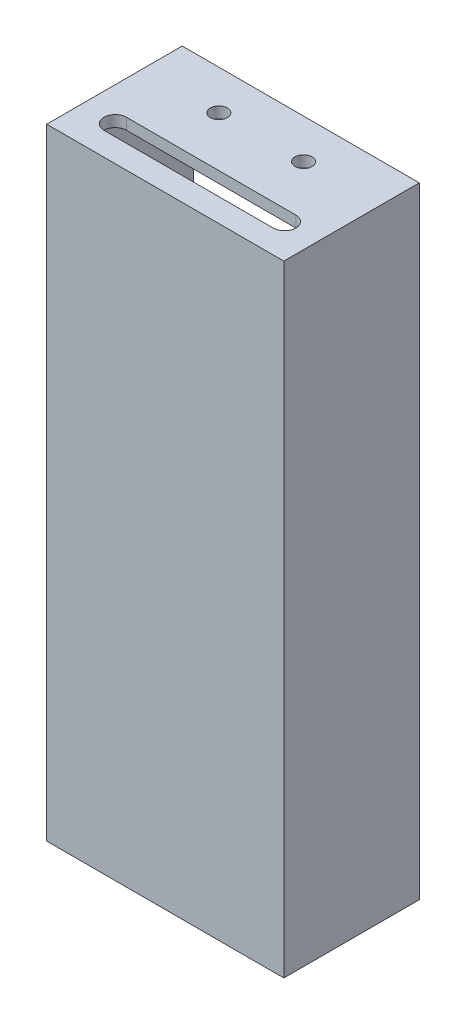
ISO-10303-21;
HEADER;
FILE_DESCRIPTION(('STEP AP214'),'2;1');
FILE_NAME('part.step','',(''),(''),'','','');
FILE_SCHEMA(('AUTOMOTIVE_DESIGN { 1 0 10303 214 1 1 1 1 }'));
ENDSEC;
DATA;
#1=APPLICATION_CONTEXT('core data for automotive mechanical design processes');
#2=APPLICATION_PROTOCOL_DEFINITION('international standard','automotive_design',2000,#1);
#3=PRODUCT_CONTEXT('',#1,'mechanical');
#4=PRODUCT('Part','Part','',(#3));
#5=PRODUCT_RELATED_PRODUCT_CATEGORY('part','',(#4));
#6=PRODUCT_DEFINITION_FORMATION('','',#4);
#7=PRODUCT_DEFINITION_CONTEXT('part definition',#1,'design');
#8=PRODUCT_DEFINITION('design','',#6,#7);
#9=PRODUCT_DEFINITION_SHAPE('','',#8);
#10=(LENGTH_UNIT() NAMED_UNIT(*) SI_UNIT(.MILLI.,.METRE.));
#11=(NAMED_UNIT(*) PLANE_ANGLE_UNIT() SI_UNIT($,.RADIAN.));
#12=(NAMED_UNIT(*) SI_UNIT($,.STERADIAN.) SOLID_ANGLE_UNIT());
#13=UNCERTAINTY_MEASURE_WITH_UNIT(LENGTH_MEASURE(1.E-05),#10,'distance_accuracy_value','');
#14=(GEOMETRIC_REPRESENTATION_CONTEXT(3) GLOBAL_UNCERTAINTY_ASSIGNED_CONTEXT((#13)) GLOBAL_UNIT_ASSIGNED_CONTEXT((#10,
#11,#12)) REPRESENTATION_CONTEXT('',''));
#15=CARTESIAN_POINT('',(0.,0.,0.));
#16=DIRECTION('',(0.,0.,1.));
#17=DIRECTION('',(1.,0.,0.));
#18=AXIS2_PLACEMENT_3D('',#15,#16,#17);
#19=CARTESIAN_POINT('',(0.,32.6753246753247,-22.));
#20=DIRECTION('',(1.,0.,0.));
#21=DIRECTION('',(0.,1.,0.));
#22=AXIS2_PLACEMENT_3D('',#19,#20,#21);
#23=PLANE('',#22);
#24=DIRECTION('',(0.,-1.,0.));
#25=VECTOR('',#24,1.);
#26=CARTESIAN_POINT('',(0.,32.6753246753247,-20.));
#27=LINE('',#26,#25);
#28=CARTESIAN_POINT('',(0.,32.6753246753247,-20.));
#29=VERTEX_POINT('',#28);
#30=CARTESIAN_POINT('',(0.,-34.3246753246753,-20.));
#31=VERTEX_POINT('',#30);
#32=EDGE_CURVE('E215',#29,#31,#27,.T.);
#33=ORIENTED_EDGE('',*,*,#32,.T.);
#34=DIRECTION('',(0.,0.,1.));
#35=VECTOR('',#34,1.);
#36=CARTESIAN_POINT('',(0.,-34.3246753246753,0.));
#37=LINE('',#36,#35);
#38=CARTESIAN_POINT('',(0.,-34.3246753246753,0.));
#39=VERTEX_POINT('',#38);
#40=EDGE_CURVE('E228',#31,#39,#37,.T.);
#41=ORIENTED_EDGE('',*,*,#40,.T.);
#42=DIRECTION('',(0.,1.,0.));
#43=VECTOR('',#42,1.);
#44=CARTESIAN_POINT('',(0.,73.6753246753247,0.));
#45=LINE('',#44,#43);
#46=CARTESIAN_POINT('',(0.,32.6753246753247,0.));
#47=VERTEX_POINT('',#46);
#48=EDGE_CURVE('E474',#39,#47,#45,.T.);
#49=ORIENTED_EDGE('',*,*,#48,.T.);
#50=DIRECTION('',(0.,0.,1.));
#51=VECTOR('',#50,1.);
#52=CARTESIAN_POINT('',(0.,32.6753246753247,-22.));
#53=LINE('',#52,#51);
#54=EDGE_CURVE('E387',#29,#47,#53,.T.);
#55=ORIENTED_EDGE('',*,*,#54,.F.);
#56=EDGE_LOOP('',(#33,#41,#49,#55));
#57=FACE_BOUND('',#56,.T.);
#58=ADVANCED_FACE('F45',(#57),#23,.F.);
#59=CARTESIAN_POINT('',(-38.,32.6753246753247,-22.));
#60=DIRECTION('',(-1.,0.,0.));
#61=DIRECTION('',(0.,0.,1.));
#62=AXIS2_PLACEMENT_3D('',#59,#60,#61);
#63=PLANE('',#62);
#64=DIRECTION('',(0.,0.,1.));
#65=VECTOR('',#64,1.);
#66=CARTESIAN_POINT('',(-38.,22.6753246753247,-22.));
#67=LINE('',#66,#65);
#68=CARTESIAN_POINT('',(-38.,22.6753246753247,-10.));
#69=VERTEX_POINT('',#68);
#70=CARTESIAN_POINT('',(-38.,22.6753246753247,-4.));
#71=VERTEX_POINT('',#70);
#72=EDGE_CURVE('E379',#69,#71,#67,.T.);
#73=ORIENTED_EDGE('',*,*,#72,.T.);
#74=DIRECTION('',(0.,1.,0.));
#75=VECTOR('',#74,1.);
#76=CARTESIAN_POINT('',(-38.,32.6753246753247,-4.));
#77=LINE('',#76,#75);
#78=CARTESIAN_POINT('',(-38.,30.6753246753247,-4.));
#79=VERTEX_POINT('',#78);
#80=EDGE_CURVE('E383',#71,#79,#77,.T.);
#81=ORIENTED_EDGE('',*,*,#80,.T.);
#82=DIRECTION('',(0.,0.,-1.));
#83=VECTOR('',#82,1.);
#84=CARTESIAN_POINT('',(-38.,30.6753246753247,-22.));
#85=LINE('',#84,#83);
#86=CARTESIAN_POINT('',(-38.,30.6753246753247,-10.));
#87=VERTEX_POINT('',#86);
#88=EDGE_CURVE('E371',#79,#87,#85,.T.);
#89=ORIENTED_EDGE('',*,*,#88,.T.);
#90=DIRECTION('',(0.,-1.,0.));
#91=VECTOR('',#90,1.);
#92=CARTESIAN_POINT('',(-38.,32.6753246753247,-10.));
#93=LINE('',#92,#91);
#94=EDGE_CURVE('E375',#87,#69,#93,.T.);
#95=ORIENTED_EDGE('',*,*,#94,.T.);
#96=EDGE_LOOP('',(#73,#81,#89,#95));
#97=FACE_BOUND('',#96,.T.);
#98=DIRECTION('',(0.,1.,0.));
#99=VECTOR('',#98,1.);
#100=CARTESIAN_POINT('',(-38.,32.6753246753247,-20.));
#101=LINE('',#100,#99);
#102=CARTESIAN_POINT('',(-38.,-34.3246753246753,-20.));
#103=VERTEX_POINT('',#102);
#104=CARTESIAN_POINT('',(-38.,32.6753246753247,-20.));
#105=VERTEX_POINT('',#104);
#106=EDGE_CURVE('E208',#103,#105,#101,.T.);
#107=ORIENTED_EDGE('',*,*,#106,.T.);
#108=DIRECTION('',(0.,0.,1.));
#109=VECTOR('',#108,1.);
#110=CARTESIAN_POINT('',(-38.,32.6753246753247,-22.));
#111=LINE('',#110,#109);
#112=CARTESIAN_POINT('',(-38.,32.6753246753247,0.));
#113=VERTEX_POINT('',#112);
#114=EDGE_CURVE('E388',#105,#113,#111,.T.);
#115=ORIENTED_EDGE('',*,*,#114,.T.);
#116=DIRECTION('',(0.,-1.,0.));
#117=VECTOR('',#116,1.);
#118=CARTESIAN_POINT('',(-38.,73.6753246753247,0.));
#119=LINE('',#118,#117);
#120=CARTESIAN_POINT('',(-38.,-34.3246753246753,0.));
#121=VERTEX_POINT('',#120);
#122=EDGE_CURVE('E61',#113,#121,#119,.T.);
#123=ORIENTED_EDGE('',*,*,#122,.T.);
#124=DIRECTION('',(0.,0.,-1.));
#125=VECTOR('',#124,1.);
#126=CARTESIAN_POINT('',(-38.,-34.3246753246753,0.));
#127=LINE('',#126,#125);
#128=EDGE_CURVE('E218',#121,#103,#127,.T.);
#129=ORIENTED_EDGE('',*,*,#128,.T.);
#130=EDGE_LOOP('',(#107,#115,#123,#129));
#131=FACE_BOUND('',#130,.T.);
#132=ADVANCED_FACE('F219',(#97,#131),#63,.F.);
#133=CARTESIAN_POINT('',(-38.,32.6753246753247,-22.));
#134=DIRECTION('',(0.,1.,0.));
#135=DIRECTION('',(0.,0.,1.));
#136=AXIS2_PLACEMENT_3D('',#133,#134,#135);
#137=PLANE('',#136);
#138=DIRECTION('',(1.,0.,0.));
#139=VECTOR('',#138,1.);
#140=CARTESIAN_POINT('',(0.,32.6753246753247,-20.));
#141=LINE('',#140,#139);
#142=EDGE_CURVE('E69',#105,#29,#141,.T.);
#143=ORIENTED_EDGE('',*,*,#142,.T.);
#144=ORIENTED_EDGE('',*,*,#54,.T.);
#145=DIRECTION('',(-1.,0.,0.));
#146=VECTOR('',#145,1.);
#147=CARTESIAN_POINT('',(0.,32.6753246753247,0.));
#148=LINE('',#147,#146);
#149=EDGE_CURVE('E54',#47,#113,#148,.T.);
#150=ORIENTED_EDGE('',*,*,#149,.T.);
#151=ORIENTED_EDGE('',*,*,#114,.F.);
#152=EDGE_LOOP('',(#143,#144,#150,#151));
#153=FACE_BOUND('',#152,.T.);
#154=ADVANCED_FACE('F484',(#153),#137,.F.);
#155=CARTESIAN_POINT('',(-38.,73.6753246753247,-22.));
#156=DIRECTION('',(-1.,0.,0.));
#157=DIRECTION('',(0.,-1.,0.));
#158=AXIS2_PLACEMENT_3D('',#155,#156,#157);
#159=PLANE('',#158);
#160=DIRECTION('',(0.,0.,-1.));
#161=VECTOR('',#160,1.);
#162=CARTESIAN_POINT('',(-38.,57.6753246753246,-22.));
#163=LINE('',#162,#161);
#164=CARTESIAN_POINT('',(-38.,57.6753246753247,-4.));
#165=VERTEX_POINT('',#164);
#166=CARTESIAN_POINT('',(-38.,57.6753246753247,-10.));
#167=VERTEX_POINT('',#166);
#168=EDGE_CURVE('E363',#165,#167,#163,.T.);
#169=ORIENTED_EDGE('',*,*,#168,.T.);
#170=DIRECTION('',(0.,-1.,0.));
#171=VECTOR('',#170,1.);
#172=CARTESIAN_POINT('',(-38.,73.6753246753247,-10.));
#173=LINE('',#172,#171);
#174=CARTESIAN_POINT('',(-38.,49.6753246753247,-10.));
#175=VERTEX_POINT('',#174);
#176=EDGE_CURVE('E367',#167,#175,#173,.T.);
#177=ORIENTED_EDGE('',*,*,#176,.T.);
#178=DIRECTION('',(0.,0.,1.));
#179=VECTOR('',#178,1.);
#180=CARTESIAN_POINT('',(-38.,49.6753246753247,-22.));
#181=LINE('',#180,#179);
#182=CARTESIAN_POINT('',(-38.,49.6753246753247,-4.));
#183=VERTEX_POINT('',#182);
#184=EDGE_CURVE('E320',#175,#183,#181,.T.);
#185=ORIENTED_EDGE('',*,*,#184,.T.);
#186=DIRECTION('',(0.,1.,0.));
#187=VECTOR('',#186,1.);
#188=CARTESIAN_POINT('',(-38.,73.6753246753247,-4.));
#189=LINE('',#188,#187);
#190=EDGE_CURVE('E359',#183,#165,#189,.T.);
#191=ORIENTED_EDGE('',*,*,#190,.T.);
#192=EDGE_LOOP('',(#169,#177,#185,#191));
#193=FACE_BOUND('',#192,.T.);
#194=DIRECTION('',(0.,0.,1.));
#195=VECTOR('',#194,1.);
#196=CARTESIAN_POINT('',(-38.,73.6753246753247,-22.));
#197=LINE('',#196,#195);
#198=CARTESIAN_POINT('',(-38.,73.6753246753247,-22.));
#199=VERTEX_POINT('',#198);
#200=CARTESIAN_POINT('',(-38.,73.6753246753247,0.));
#201=VERTEX_POINT('',#200);
#202=EDGE_CURVE('E410',#199,#201,#197,.T.);
#203=ORIENTED_EDGE('',*,*,#202,.T.);
#204=CARTESIAN_POINT('',(-38.,34.6753246753247,0.));
#205=VERTEX_POINT('',#204);
#206=EDGE_CURVE('E469',#201,#205,#119,.T.);
#207=ORIENTED_EDGE('',*,*,#206,.T.);
#208=DIRECTION('',(0.,0.,1.));
#209=VECTOR('',#208,1.);
#210=CARTESIAN_POINT('',(-38.,34.6753246753247,-22.));
#211=LINE('',#210,#209);
#212=CARTESIAN_POINT('',(-38.,34.6753246753247,-22.));
#213=VERTEX_POINT('',#212);
#214=EDGE_CURVE('E409',#213,#205,#211,.T.);
#215=ORIENTED_EDGE('',*,*,#214,.F.);
#216=DIRECTION('',(0.,-1.,0.));
#217=VECTOR('',#216,1.);
#218=CARTESIAN_POINT('',(-38.,73.6753246753247,-22.));
#219=LINE('',#218,#217);
#220=EDGE_CURVE('E391',#199,#213,#219,.T.);
#221=ORIENTED_EDGE('',*,*,#220,.F.);
#222=EDGE_LOOP('',(#203,#207,#215,#221));
#223=FACE_BOUND('',#222,.T.);
#224=ADVANCED_FACE('F503',(#193,#223),#159,.F.);
#225=CARTESIAN_POINT('',(-38.,73.6753246753247,-22.));
#226=DIRECTION('',(0.,1.,0.));
#227=DIRECTION('',(0.,0.,1.));
#228=AXIS2_PLACEMENT_3D('',#225,#226,#227);
#229=PLANE('',#228);
#230=DIRECTION('',(-1.,0.,0.));
#231=VECTOR('',#230,1.);
#232=CARTESIAN_POINT('',(-38.,73.6753246753247,-6.13092025352539));
#233=LINE('',#232,#231);
#234=CARTESIAN_POINT('',(-4.00000000000002,73.6753246753247,-6.1309202535254));
#235=VERTEX_POINT('',#234);
#236=CARTESIAN_POINT('',(-34.,73.6753246753247,-6.13092025352539));
#237=VERTEX_POINT('',#236);
#238=EDGE_CURVE('E291',#235,#237,#233,.T.);
#239=ORIENTED_EDGE('',*,*,#238,.T.);
#240=CARTESIAN_POINT('',(-34.,73.6753246753247,-4.13092025352539));
#241=DIRECTION('',(0.,1.,0.));
#242=DIRECTION('',(0.,0.,1.));
#243=AXIS2_PLACEMENT_3D('',#240,#241,#242);
#244=CIRCLE('',#243,1.99999999999999);
#245=CARTESIAN_POINT('',(-34.,73.6753246753247,-2.13092025352541));
#246=VERTEX_POINT('',#245);
#247=EDGE_CURVE('E295',#237,#246,#244,.T.);
#248=ORIENTED_EDGE('',*,*,#247,.T.);
#249=DIRECTION('',(1.,0.,0.));
#250=VECTOR('',#249,1.);
#251=CARTESIAN_POINT('',(-38.,73.6753246753247,-2.13092025352541));
#252=LINE('',#251,#250);
#253=CARTESIAN_POINT('',(-4.00000000000001,73.6753246753247,-2.13092025352541));
#254=VERTEX_POINT('',#253);
#255=EDGE_CURVE('E283',#246,#254,#252,.T.);
#256=ORIENTED_EDGE('',*,*,#255,.T.);
#257=CARTESIAN_POINT('',(-4.00000000000001,73.6753246753247,-4.1309202535254));
#258=DIRECTION('',(0.,1.,0.));
#259=DIRECTION('',(0.,0.,1.));
#260=AXIS2_PLACEMENT_3D('',#257,#258,#259);
#261=CIRCLE('',#260,1.99999999999999);
#262=EDGE_CURVE('E287',#254,#235,#261,.T.);
#263=ORIENTED_EDGE('',*,*,#262,.T.);
#264=EDGE_LOOP('',(#239,#248,#256,#263));
#265=FACE_BOUND('',#264,.T.);
#266=CARTESIAN_POINT('',(-11.5,73.6753246753247,-15.));
#267=DIRECTION('',(0.,1.,0.));
#268=DIRECTION('',(0.,0.,1.));
#269=AXIS2_PLACEMENT_3D('',#266,#267,#268);
#270=CIRCLE('',#269,1.5);
#271=CARTESIAN_POINT('',(-11.5,73.6753246753247,-13.5));
#272=VERTEX_POINT('',#271);
#273=EDGE_CURVE('E279',#272,#272,#270,.T.);
#274=ORIENTED_EDGE('',*,*,#273,.T.);
#275=EDGE_LOOP('',(#274));
#276=FACE_BOUND('',#275,.T.);
#277=CARTESIAN_POINT('',(-26.5,73.6753246753247,-15.));
#278=DIRECTION('',(0.,1.,0.));
#279=DIRECTION('',(0.,0.,1.));
#280=AXIS2_PLACEMENT_3D('',#277,#278,#279);
#281=CIRCLE('',#280,1.5);
#282=CARTESIAN_POINT('',(-26.5,73.6753246753247,-13.5));
#283=VERTEX_POINT('',#282);
#284=EDGE_CURVE('E275',#283,#283,#281,.T.);
#285=ORIENTED_EDGE('',*,*,#284,.T.);
#286=EDGE_LOOP('',(#285));
#287=FACE_BOUND('',#286,.T.);
#288=DIRECTION('',(0.,0.,1.));
#289=VECTOR('',#288,1.);
#290=CARTESIAN_POINT('',(0.,73.6753246753247,-22.));
#291=LINE('',#290,#289);
#292=CARTESIAN_POINT('',(0.,73.6753246753247,-22.));
#293=VERTEX_POINT('',#292);
#294=CARTESIAN_POINT('',(0.,73.6753246753247,0.));
#295=VERTEX_POINT('',#294);
#296=EDGE_CURVE('E415',#293,#295,#291,.T.);
#297=ORIENTED_EDGE('',*,*,#296,.T.);
#298=DIRECTION('',(-1.,0.,0.));
#299=VECTOR('',#298,1.);
#300=CARTESIAN_POINT('',(-38.,73.6753246753247,0.));
#301=LINE('',#300,#299);
#302=EDGE_CURVE('E478',#295,#201,#301,.T.);
#303=ORIENTED_EDGE('',*,*,#302,.T.);
#304=ORIENTED_EDGE('',*,*,#202,.F.);
#305=DIRECTION('',(-1.,0.,0.));
#306=VECTOR('',#305,1.);
#307=CARTESIAN_POINT('',(-38.,73.6753246753247,-22.));
#308=LINE('',#307,#306);
#309=EDGE_CURVE('E405',#293,#199,#308,.T.);
#310=ORIENTED_EDGE('',*,*,#309,.F.);
#311=EDGE_LOOP('',(#297,#303,#304,#310));
#312=FACE_BOUND('',#311,.T.);
#313=ADVANCED_FACE('F499',(#265,#276,#287,#312),#229,.F.);
#314=CARTESIAN_POINT('',(0.,73.6753246753247,-22.));
#315=DIRECTION('',(1.,0.,0.));
#316=DIRECTION('',(0.,0.,-1.));
#317=AXIS2_PLACEMENT_3D('',#314,#315,#316);
#318=PLANE('',#317);
#319=DIRECTION('',(0.,0.,1.));
#320=VECTOR('',#319,1.);
#321=CARTESIAN_POINT('',(0.,34.6753246753247,-22.));
#322=LINE('',#321,#320);
#323=CARTESIAN_POINT('',(0.,34.6753246753247,-22.));
#324=VERTEX_POINT('',#323);
#325=CARTESIAN_POINT('',(0.,34.6753246753247,0.));
#326=VERTEX_POINT('',#325);
#327=EDGE_CURVE('E419',#324,#326,#322,.T.);
#328=ORIENTED_EDGE('',*,*,#327,.T.);
#329=EDGE_CURVE('E473',#326,#295,#45,.T.);
#330=ORIENTED_EDGE('',*,*,#329,.T.);
#331=ORIENTED_EDGE('',*,*,#296,.F.);
#332=DIRECTION('',(0.,1.,0.));
#333=VECTOR('',#332,1.);
#334=CARTESIAN_POINT('',(0.,73.6753246753247,-22.));
#335=LINE('',#334,#333);
#336=EDGE_CURVE('E401',#324,#293,#335,.T.);
#337=ORIENTED_EDGE('',*,*,#336,.F.);
#338=EDGE_LOOP('',(#328,#330,#331,#337));
#339=FACE_BOUND('',#338,.T.);
#340=ADVANCED_FACE('F502',(#339),#318,.F.);
#341=CARTESIAN_POINT('',(-38.,34.6753246753247,-22.));
#342=DIRECTION('',(0.,-1.,0.));
#343=DIRECTION('',(0.,0.,-1.));
#344=AXIS2_PLACEMENT_3D('',#341,#342,#343);
#345=PLANE('',#344);
#346=ORIENTED_EDGE('',*,*,#214,.T.);
#347=DIRECTION('',(1.,0.,0.));
#348=VECTOR('',#347,1.);
#349=CARTESIAN_POINT('',(0.,34.6753246753247,0.));
#350=LINE('',#349,#348);
#351=EDGE_CURVE('E11',#205,#326,#350,.T.);
#352=ORIENTED_EDGE('',*,*,#351,.T.);
#353=ORIENTED_EDGE('',*,*,#327,.F.);
#354=DIRECTION('',(1.,0.,0.));
#355=VECTOR('',#354,1.);
#356=CARTESIAN_POINT('',(-38.,34.6753246753247,-22.));
#357=LINE('',#356,#355);
#358=EDGE_CURVE('E397',#213,#324,#357,.T.);
#359=ORIENTED_EDGE('',*,*,#358,.F.);
#360=EDGE_LOOP('',(#346,#352,#353,#359));
#361=FACE_BOUND('',#360,.T.);
#362=ADVANCED_FACE('F507',(#361),#345,.F.);
#363=CARTESIAN_POINT('',(-40.,75.6753246753247,-22.));
#364=DIRECTION('',(0.,1.,0.));
#365=DIRECTION('',(0.,0.,1.));
#366=AXIS2_PLACEMENT_3D('',#363,#364,#365);
#367=PLANE('',#366);
#368=CARTESIAN_POINT('',(-34.,75.6753246753247,-4.13092025352539));
#369=DIRECTION('',(0.,1.,0.));
#370=DIRECTION('',(0.,0.,1.));
#371=AXIS2_PLACEMENT_3D('',#368,#369,#370);
#372=CIRCLE('',#371,1.99999999999999);
#373=CARTESIAN_POINT('',(-34.,75.6753246753247,-6.13092025352539));
#374=VERTEX_POINT('',#373);
#375=CARTESIAN_POINT('',(-34.,75.6753246753247,-2.13092025352541));
#376=VERTEX_POINT('',#375);
#377=EDGE_CURVE('E245',#374,#376,#372,.T.);
#378=ORIENTED_EDGE('',*,*,#377,.F.);
#379=DIRECTION('',(-1.,0.,0.));
#380=VECTOR('',#379,1.);
#381=CARTESIAN_POINT('',(-34.,75.6753246753247,-6.13092025352539));
#382=LINE('',#381,#380);
#383=CARTESIAN_POINT('',(-4.00000000000002,75.6753246753247,-6.1309202535254));
#384=VERTEX_POINT('',#383);
#385=EDGE_CURVE('E250',#384,#374,#382,.T.);
#386=ORIENTED_EDGE('',*,*,#385,.F.);
#387=CARTESIAN_POINT('',(-4.00000000000001,75.6753246753247,-4.1309202535254));
#388=DIRECTION('',(0.,1.,0.));
#389=DIRECTION('',(0.,0.,1.));
#390=AXIS2_PLACEMENT_3D('',#387,#388,#389);
#391=CIRCLE('',#390,1.99999999999999);
#392=CARTESIAN_POINT('',(-4.00000000000001,75.6753246753247,-2.13092025352541));
#393=VERTEX_POINT('',#392);
#394=EDGE_CURVE('E262',#393,#384,#391,.T.);
#395=ORIENTED_EDGE('',*,*,#394,.F.);
#396=DIRECTION('',(1.,0.,0.));
#397=VECTOR('',#396,1.);
#398=CARTESIAN_POINT('',(-34.,75.6753246753247,-2.13092025352541));
#399=LINE('',#398,#397);
#400=EDGE_CURVE('E266',#376,#393,#399,.T.);
#401=ORIENTED_EDGE('',*,*,#400,.F.);
#402=EDGE_LOOP('',(#378,#386,#395,#401));
#403=FACE_BOUND('',#402,.T.);
#404=CARTESIAN_POINT('',(-11.5,75.6753246753247,-15.));
#405=DIRECTION('',(0.,1.,0.));
#406=DIRECTION('',(0.,0.,1.));
#407=AXIS2_PLACEMENT_3D('',#404,#405,#406);
#408=CIRCLE('',#407,1.5);
#409=CARTESIAN_POINT('',(-11.5,75.6753246753247,-13.5));
#410=VERTEX_POINT('',#409);
#411=EDGE_CURVE('E240',#410,#410,#408,.T.);
#412=ORIENTED_EDGE('',*,*,#411,.F.);
#413=EDGE_LOOP('',(#412));
#414=FACE_BOUND('',#413,.T.);
#415=CARTESIAN_POINT('',(-26.5,75.6753246753247,-15.));
#416=DIRECTION('',(0.,1.,0.));
#417=DIRECTION('',(0.,0.,1.));
#418=AXIS2_PLACEMENT_3D('',#415,#416,#417);
#419=CIRCLE('',#418,1.5);
#420=CARTESIAN_POINT('',(-26.5,75.6753246753247,-13.5));
#421=VERTEX_POINT('',#420);
#422=EDGE_CURVE('E244',#421,#421,#419,.T.);
#423=ORIENTED_EDGE('',*,*,#422,.F.);
#424=EDGE_LOOP('',(#423));
#425=FACE_BOUND('',#424,.T.);
#426=DIRECTION('',(-1.,0.,0.));
#427=VECTOR('',#426,1.);
#428=CARTESIAN_POINT('',(-40.,75.6753246753247,2.));
#429=LINE('',#428,#427);
#430=CARTESIAN_POINT('',(1.99999999999999,75.6753246753247,2.));
#431=VERTEX_POINT('',#430);
#432=CARTESIAN_POINT('',(-40.,75.6753246753247,2.));
#433=VERTEX_POINT('',#432);
#434=EDGE_CURVE('E414',#431,#433,#429,.T.);
#435=ORIENTED_EDGE('',*,*,#434,.F.);
#436=DIRECTION('',(0.,0.,1.));
#437=VECTOR('',#436,1.);
#438=CARTESIAN_POINT('',(1.99999999999999,75.6753246753247,-22.));
#439=LINE('',#438,#437);
#440=CARTESIAN_POINT('',(1.99999999999999,75.6753246753247,-22.));
#441=VERTEX_POINT('',#440);
#442=EDGE_CURVE('E458',#441,#431,#439,.T.);
#443=ORIENTED_EDGE('',*,*,#442,.F.);
#444=DIRECTION('',(-1.,0.,0.));
#445=VECTOR('',#444,1.);
#446=CARTESIAN_POINT('',(-40.,75.6753246753247,-22.));
#447=LINE('',#446,#445);
#448=CARTESIAN_POINT('',(-40.,75.6753246753247,-22.));
#449=VERTEX_POINT('',#448);
#450=EDGE_CURVE('E426',#441,#449,#447,.T.);
#451=ORIENTED_EDGE('',*,*,#450,.T.);
#452=DIRECTION('',(0.,0.,1.));
#453=VECTOR('',#452,1.);
#454=CARTESIAN_POINT('',(-40.,75.6753246753247,-22.));
#455=LINE('',#454,#453);
#456=EDGE_CURVE('E443',#449,#433,#455,.T.);
#457=ORIENTED_EDGE('',*,*,#456,.T.);
#458=EDGE_LOOP('',(#435,#443,#451,#457));
#459=FACE_BOUND('',#458,.T.);
#460=ADVANCED_FACE('F511',(#403,#414,#425,#459),#367,.T.);
#461=CARTESIAN_POINT('',(1.99999999999999,75.6753246753247,-22.));
#462=DIRECTION('',(1.,0.,0.));
#463=DIRECTION('',(0.,1.,0.));
#464=AXIS2_PLACEMENT_3D('',#461,#462,#463);
#465=PLANE('',#464);
#466=DIRECTION('',(0.,1.,0.));
#467=VECTOR('',#466,1.);
#468=CARTESIAN_POINT('',(1.99999999999999,75.6753246753247,2.));
#469=LINE('',#468,#467);
#470=CARTESIAN_POINT('',(2.,-34.3246753246753,2.));
#471=VERTEX_POINT('',#470);
#472=EDGE_CURVE('E431',#471,#431,#469,.T.);
#473=ORIENTED_EDGE('',*,*,#472,.F.);
#474=DIRECTION('',(0.,0.,1.));
#475=VECTOR('',#474,1.);
#476=CARTESIAN_POINT('',(2.,-34.3246753246753,-22.));
#477=LINE('',#476,#475);
#478=CARTESIAN_POINT('',(2.,-34.3246753246753,-22.));
#479=VERTEX_POINT('',#478);
#480=EDGE_CURVE('E461',#479,#471,#477,.T.);
#481=ORIENTED_EDGE('',*,*,#480,.F.);
#482=DIRECTION('',(0.,1.,0.));
#483=VECTOR('',#482,1.);
#484=CARTESIAN_POINT('',(1.99999999999999,75.6753246753247,-22.));
#485=LINE('',#484,#483);
#486=EDGE_CURVE('E439',#479,#441,#485,.T.);
#487=ORIENTED_EDGE('',*,*,#486,.T.);
#488=ORIENTED_EDGE('',*,*,#442,.T.);
#489=EDGE_LOOP('',(#473,#481,#487,#488));
#490=FACE_BOUND('',#489,.T.);
#491=ADVANCED_FACE('F520',(#490),#465,.T.);
#492=CARTESIAN_POINT('',(-40.,-34.3246753246753,-22.));
#493=DIRECTION('',(0.,-1.,0.));
#494=DIRECTION('',(0.,0.,-1.));
#495=AXIS2_PLACEMENT_3D('',#492,#493,#494);
#496=PLANE('',#495);
#497=DIRECTION('',(-1.,0.,0.));
#498=VECTOR('',#497,1.);
#499=CARTESIAN_POINT('',(-38.,-34.3246753246753,0.));
#500=LINE('',#499,#498);
#501=EDGE_CURVE('E223',#39,#121,#500,.T.);
#502=ORIENTED_EDGE('',*,*,#501,.F.);
#503=ORIENTED_EDGE('',*,*,#40,.F.);
#504=DIRECTION('',(1.,0.,0.));
#505=VECTOR('',#504,1.);
#506=CARTESIAN_POINT('',(-38.,-34.3246753246753,-20.));
#507=LINE('',#506,#505);
#508=EDGE_CURVE('E212',#103,#31,#507,.T.);
#509=ORIENTED_EDGE('',*,*,#508,.F.);
#510=ORIENTED_EDGE('',*,*,#128,.F.);
#511=EDGE_LOOP('',(#502,#503,#509,#510));
#512=FACE_BOUND('',#511,.T.);
#513=DIRECTION('',(1.,0.,0.));
#514=VECTOR('',#513,1.);
#515=CARTESIAN_POINT('',(-40.,-34.3246753246753,2.));
#516=LINE('',#515,#514);
#517=CARTESIAN_POINT('',(-40.,-34.3246753246753,2.));
#518=VERTEX_POINT('',#517);
#519=EDGE_CURVE('E451',#518,#471,#516,.T.);
#520=ORIENTED_EDGE('',*,*,#519,.F.);
#521=DIRECTION('',(0.,0.,1.));
#522=VECTOR('',#521,1.);
#523=CARTESIAN_POINT('',(-40.,-34.3246753246753,-22.));
#524=LINE('',#523,#522);
#525=CARTESIAN_POINT('',(-40.,-34.3246753246753,-22.));
#526=VERTEX_POINT('',#525);
#527=EDGE_CURVE('E464',#526,#518,#524,.T.);
#528=ORIENTED_EDGE('',*,*,#527,.F.);
#529=DIRECTION('',(1.,0.,0.));
#530=VECTOR('',#529,1.);
#531=CARTESIAN_POINT('',(-40.,-34.3246753246753,-22.));
#532=LINE('',#531,#530);
#533=EDGE_CURVE('E435',#526,#479,#532,.T.);
#534=ORIENTED_EDGE('',*,*,#533,.T.);
#535=ORIENTED_EDGE('',*,*,#480,.T.);
#536=EDGE_LOOP('',(#520,#528,#534,#535));
#537=FACE_BOUND('',#536,.T.);
#538=ADVANCED_FACE('F225',(#512,#537),#496,.T.);
#539=CARTESIAN_POINT('',(-40.,75.6753246753247,-22.));
#540=DIRECTION('',(-1.,0.,0.));
#541=DIRECTION('',(0.,-1.,0.));
#542=AXIS2_PLACEMENT_3D('',#539,#540,#541);
#543=PLANE('',#542);
#544=DIRECTION('',(0.,1.,0.));
#545=VECTOR('',#544,1.);
#546=CARTESIAN_POINT('',(-40.,30.6753246753247,-4.));
#547=LINE('',#546,#545);
#548=CARTESIAN_POINT('',(-40.,22.6753246753247,-4.));
#549=VERTEX_POINT('',#548);
#550=CARTESIAN_POINT('',(-40.,30.6753246753247,-4.));
#551=VERTEX_POINT('',#550);
#552=EDGE_CURVE('E300',#549,#551,#547,.T.);
#553=ORIENTED_EDGE('',*,*,#552,.F.);
#554=DIRECTION('',(0.,0.,1.));
#555=VECTOR('',#554,1.);
#556=CARTESIAN_POINT('',(-40.,22.6753246753247,-4.));
#557=LINE('',#556,#555);
#558=CARTESIAN_POINT('',(-40.,22.6753246753247,-10.));
#559=VERTEX_POINT('',#558);
#560=EDGE_CURVE('E312',#559,#549,#557,.T.);
#561=ORIENTED_EDGE('',*,*,#560,.F.);
#562=DIRECTION('',(0.,-1.,0.));
#563=VECTOR('',#562,1.);
#564=CARTESIAN_POINT('',(-40.,30.6753246753247,-10.));
#565=LINE('',#564,#563);
#566=CARTESIAN_POINT('',(-40.,30.6753246753247,-10.));
#567=VERTEX_POINT('',#566);
#568=EDGE_CURVE('E308',#567,#559,#565,.T.);
#569=ORIENTED_EDGE('',*,*,#568,.F.);
#570=DIRECTION('',(0.,0.,-1.));
#571=VECTOR('',#570,1.);
#572=CARTESIAN_POINT('',(-40.,30.6753246753247,-4.));
#573=LINE('',#572,#571);
#574=EDGE_CURVE('E303',#551,#567,#573,.T.);
#575=ORIENTED_EDGE('',*,*,#574,.F.);
#576=EDGE_LOOP('',(#553,#561,#569,#575));
#577=FACE_BOUND('',#576,.T.);
#578=DIRECTION('',(0.,-1.,0.));
#579=VECTOR('',#578,1.);
#580=CARTESIAN_POINT('',(-40.,57.6753246753247,-10.));
#581=LINE('',#580,#579);
#582=CARTESIAN_POINT('',(-40.,57.6753246753247,-10.));
#583=VERTEX_POINT('',#582);
#584=CARTESIAN_POINT('',(-40.,49.6753246753247,-10.));
#585=VERTEX_POINT('',#584);
#586=EDGE_CURVE('E304',#583,#585,#581,.T.);
#587=ORIENTED_EDGE('',*,*,#586,.F.);
#588=DIRECTION('',(0.,0.,-1.));
#589=VECTOR('',#588,1.);
#590=CARTESIAN_POINT('',(-40.,57.6753246753247,-10.));
#591=LINE('',#590,#589);
#592=CARTESIAN_POINT('',(-40.,57.6753246753247,-4.));
#593=VERTEX_POINT('',#592);
#594=EDGE_CURVE('E334',#593,#583,#591,.T.);
#595=ORIENTED_EDGE('',*,*,#594,.F.);
#596=DIRECTION('',(0.,1.,0.));
#597=VECTOR('',#596,1.);
#598=CARTESIAN_POINT('',(-40.,57.6753246753247,-4.));
#599=LINE('',#598,#597);
#600=CARTESIAN_POINT('',(-40.,49.6753246753247,-4.));
#601=VERTEX_POINT('',#600);
#602=EDGE_CURVE('E346',#601,#593,#599,.T.);
#603=ORIENTED_EDGE('',*,*,#602,.F.);
#604=DIRECTION('',(0.,0.,1.));
#605=VECTOR('',#604,1.);
#606=CARTESIAN_POINT('',(-40.,49.6753246753247,-10.));
#607=LINE('',#606,#605);
#608=EDGE_CURVE('E350',#585,#601,#607,.T.);
#609=ORIENTED_EDGE('',*,*,#608,.F.);
#610=EDGE_LOOP('',(#587,#595,#603,#609));
#611=FACE_BOUND('',#610,.T.);
#612=DIRECTION('',(0.,-1.,0.));
#613=VECTOR('',#612,1.);
#614=CARTESIAN_POINT('',(-40.,75.6753246753247,2.));
#615=LINE('',#614,#613);
#616=EDGE_CURVE('E447',#433,#518,#615,.T.);
#617=ORIENTED_EDGE('',*,*,#616,.F.);
#618=ORIENTED_EDGE('',*,*,#456,.F.);
#619=DIRECTION('',(0.,-1.,0.));
#620=VECTOR('',#619,1.);
#621=CARTESIAN_POINT('',(-40.,75.6753246753247,-22.));
#622=LINE('',#621,#620);
#623=EDGE_CURVE('E430',#449,#526,#622,.T.);
#624=ORIENTED_EDGE('',*,*,#623,.T.);
#625=ORIENTED_EDGE('',*,*,#527,.T.);
#626=EDGE_LOOP('',(#617,#618,#624,#625));
#627=FACE_BOUND('',#626,.T.);
#628=ADVANCED_FACE('F518',(#577,#611,#627),#543,.T.);
#629=CARTESIAN_POINT('',(0.,0.,-22.));
#630=DIRECTION('',(0.,0.,-1.));
#631=DIRECTION('',(-1.,0.,0.));
#632=AXIS2_PLACEMENT_3D('',#629,#630,#631);
#633=PLANE('',#632);
#634=ORIENTED_EDGE('',*,*,#220,.T.);
#635=ORIENTED_EDGE('',*,*,#358,.T.);
#636=ORIENTED_EDGE('',*,*,#336,.T.);
#637=ORIENTED_EDGE('',*,*,#309,.T.);
#638=EDGE_LOOP('',(#634,#635,#636,#637));
#639=FACE_BOUND('',#638,.T.);
#640=ORIENTED_EDGE('',*,*,#450,.F.);
#641=ORIENTED_EDGE('',*,*,#486,.F.);
#642=ORIENTED_EDGE('',*,*,#533,.F.);
#643=ORIENTED_EDGE('',*,*,#623,.F.);
#644=EDGE_LOOP('',(#640,#641,#642,#643));
#645=FACE_BOUND('',#644,.T.);
#646=ADVANCED_FACE('F516',(#639,#645),#633,.T.);
#647=CARTESIAN_POINT('',(0.,0.,0.));
#648=DIRECTION('',(0.,0.,1.));
#649=DIRECTION('',(1.,0.,0.));
#650=AXIS2_PLACEMENT_3D('',#647,#648,#649);
#651=PLANE('',#650);
#652=ORIENTED_EDGE('',*,*,#149,.F.);
#653=ORIENTED_EDGE('',*,*,#48,.F.);
#654=ORIENTED_EDGE('',*,*,#501,.T.);
#655=ORIENTED_EDGE('',*,*,#122,.F.);
#656=EDGE_LOOP('',(#652,#653,#654,#655));
#657=FACE_BOUND('',#656,.T.);
#658=ADVANCED_FACE('F486',(#657),#651,.F.);
#659=ORIENTED_EDGE('',*,*,#351,.F.);
#660=ORIENTED_EDGE('',*,*,#206,.F.);
#661=ORIENTED_EDGE('',*,*,#302,.F.);
#662=ORIENTED_EDGE('',*,*,#329,.F.);
#663=EDGE_LOOP('',(#659,#660,#661,#662));
#664=FACE_BOUND('',#663,.T.);
#665=ADVANCED_FACE('F47',(#664),#651,.F.);
#666=CARTESIAN_POINT('',(0.,0.,2.));
#667=DIRECTION('',(0.,0.,1.));
#668=DIRECTION('',(1.,0.,0.));
#669=AXIS2_PLACEMENT_3D('',#666,#667,#668);
#670=PLANE('',#669);
#671=ORIENTED_EDGE('',*,*,#434,.T.);
#672=ORIENTED_EDGE('',*,*,#616,.T.);
#673=ORIENTED_EDGE('',*,*,#519,.T.);
#674=ORIENTED_EDGE('',*,*,#472,.T.);
#675=EDGE_LOOP('',(#671,#672,#673,#674));
#676=FACE_BOUND('',#675,.T.);
#677=ADVANCED_FACE('F531',(#676),#670,.T.);
#678=CARTESIAN_POINT('',(-20.,57.6753246753247,-10.));
#679=DIRECTION('',(0.,0.,-1.));
#680=DIRECTION('',(-1.,0.,0.));
#681=AXIS2_PLACEMENT_3D('',#678,#679,#680);
#682=PLANE('',#681);
#683=DIRECTION('',(-1.,0.,0.));
#684=VECTOR('',#683,1.);
#685=CARTESIAN_POINT('',(-20.,57.6753246753247,-10.));
#686=LINE('',#685,#684);
#687=EDGE_CURVE('E299',#167,#583,#686,.T.);
#688=ORIENTED_EDGE('',*,*,#687,.T.);
#689=ORIENTED_EDGE('',*,*,#586,.T.);
#690=DIRECTION('',(-1.,0.,0.));
#691=VECTOR('',#690,1.);
#692=CARTESIAN_POINT('',(-20.,49.6753246753247,-10.));
#693=LINE('',#692,#691);
#694=EDGE_CURVE('E330',#175,#585,#693,.T.);
#695=ORIENTED_EDGE('',*,*,#694,.F.);
#696=ORIENTED_EDGE('',*,*,#176,.F.);
#697=EDGE_LOOP('',(#688,#689,#695,#696));
#698=FACE_BOUND('',#697,.T.);
#699=ADVANCED_FACE('F533',(#698),#682,.F.);
#700=CARTESIAN_POINT('',(-20.,57.6753246753247,-10.));
#701=DIRECTION('',(0.,1.,0.));
#702=DIRECTION('',(-1.,0.,0.));
#703=AXIS2_PLACEMENT_3D('',#700,#701,#702);
#704=PLANE('',#703);
#705=DIRECTION('',(-1.,0.,0.));
#706=VECTOR('',#705,1.);
#707=CARTESIAN_POINT('',(-20.,57.6753246753247,-4.));
#708=LINE('',#707,#706);
#709=EDGE_CURVE('E338',#165,#593,#708,.T.);
#710=ORIENTED_EDGE('',*,*,#709,.T.);
#711=ORIENTED_EDGE('',*,*,#594,.T.);
#712=ORIENTED_EDGE('',*,*,#687,.F.);
#713=ORIENTED_EDGE('',*,*,#168,.F.);
#714=EDGE_LOOP('',(#710,#711,#712,#713));
#715=FACE_BOUND('',#714,.T.);
#716=ADVANCED_FACE('F539',(#715),#704,.F.);
#717=CARTESIAN_POINT('',(-20.,57.6753246753247,-4.));
#718=DIRECTION('',(0.,0.,1.));
#719=DIRECTION('',(0.,-1.,0.));
#720=AXIS2_PLACEMENT_3D('',#717,#718,#719);
#721=PLANE('',#720);
#722=DIRECTION('',(-1.,0.,0.));
#723=VECTOR('',#722,1.);
#724=CARTESIAN_POINT('',(-20.,49.6753246753247,-4.));
#725=LINE('',#724,#723);
#726=EDGE_CURVE('E335',#183,#601,#725,.T.);
#727=ORIENTED_EDGE('',*,*,#726,.T.);
#728=ORIENTED_EDGE('',*,*,#602,.T.);
#729=ORIENTED_EDGE('',*,*,#709,.F.);
#730=ORIENTED_EDGE('',*,*,#190,.F.);
#731=EDGE_LOOP('',(#727,#728,#729,#730));
#732=FACE_BOUND('',#731,.T.);
#733=ADVANCED_FACE('F705',(#732),#721,.F.);
#734=CARTESIAN_POINT('',(-20.,49.6753246753247,-10.));
#735=DIRECTION('',(0.,-1.,0.));
#736=DIRECTION('',(1.,0.,0.));
#737=AXIS2_PLACEMENT_3D('',#734,#735,#736);
#738=PLANE('',#737);
#739=ORIENTED_EDGE('',*,*,#694,.T.);
#740=ORIENTED_EDGE('',*,*,#608,.T.);
#741=ORIENTED_EDGE('',*,*,#726,.F.);
#742=ORIENTED_EDGE('',*,*,#184,.F.);
#743=EDGE_LOOP('',(#739,#740,#741,#742));
#744=FACE_BOUND('',#743,.T.);
#745=ADVANCED_FACE('F696',(#744),#738,.F.);
#746=CARTESIAN_POINT('',(-20.,30.6753246753247,-4.));
#747=DIRECTION('',(0.,0.,1.));
#748=DIRECTION('',(1.,0.,0.));
#749=AXIS2_PLACEMENT_3D('',#746,#747,#748);
#750=PLANE('',#749);
#751=DIRECTION('',(-1.,0.,0.));
#752=VECTOR('',#751,1.);
#753=CARTESIAN_POINT('',(-20.,22.6753246753247,-4.));
#754=LINE('',#753,#752);
#755=EDGE_CURVE('E317',#71,#549,#754,.T.);
#756=ORIENTED_EDGE('',*,*,#755,.T.);
#757=ORIENTED_EDGE('',*,*,#552,.T.);
#758=DIRECTION('',(-1.,0.,0.));
#759=VECTOR('',#758,1.);
#760=CARTESIAN_POINT('',(-20.,30.6753246753247,-4.));
#761=LINE('',#760,#759);
#762=EDGE_CURVE('E316',#79,#551,#761,.T.);
#763=ORIENTED_EDGE('',*,*,#762,.F.);
#764=ORIENTED_EDGE('',*,*,#80,.F.);
#765=EDGE_LOOP('',(#756,#757,#763,#764));
#766=FACE_BOUND('',#765,.T.);
#767=ADVANCED_FACE('F687',(#766),#750,.F.);
#768=CARTESIAN_POINT('',(-20.,22.6753246753247,-4.));
#769=DIRECTION('',(0.,-1.,0.));
#770=DIRECTION('',(1.,0.,0.));
#771=AXIS2_PLACEMENT_3D('',#768,#769,#770);
#772=PLANE('',#771);
#773=DIRECTION('',(-1.,0.,0.));
#774=VECTOR('',#773,1.);
#775=CARTESIAN_POINT('',(-20.,22.6753246753247,-10.));
#776=LINE('',#775,#774);
#777=EDGE_CURVE('E321',#69,#559,#776,.T.);
#778=ORIENTED_EDGE('',*,*,#777,.T.);
#779=ORIENTED_EDGE('',*,*,#560,.T.);
#780=ORIENTED_EDGE('',*,*,#755,.F.);
#781=ORIENTED_EDGE('',*,*,#72,.F.);
#782=EDGE_LOOP('',(#778,#779,#780,#781));
#783=FACE_BOUND('',#782,.T.);
#784=ADVANCED_FACE('F678',(#783),#772,.F.);
#785=CARTESIAN_POINT('',(-20.,30.6753246753247,-10.));
#786=DIRECTION('',(0.,0.,-1.));
#787=DIRECTION('',(0.,1.,0.));
#788=AXIS2_PLACEMENT_3D('',#785,#786,#787);
#789=PLANE('',#788);
#790=DIRECTION('',(-1.,0.,0.));
#791=VECTOR('',#790,1.);
#792=CARTESIAN_POINT('',(-20.,30.6753246753247,-10.));
#793=LINE('',#792,#791);
#794=EDGE_CURVE('E324',#87,#567,#793,.T.);
#795=ORIENTED_EDGE('',*,*,#794,.T.);
#796=ORIENTED_EDGE('',*,*,#568,.T.);
#797=ORIENTED_EDGE('',*,*,#777,.F.);
#798=ORIENTED_EDGE('',*,*,#94,.F.);
#799=EDGE_LOOP('',(#795,#796,#797,#798));
#800=FACE_BOUND('',#799,.T.);
#801=ADVANCED_FACE('F669',(#800),#789,.F.);
#802=CARTESIAN_POINT('',(-20.,30.6753246753247,-4.));
#803=DIRECTION('',(0.,1.,0.));
#804=DIRECTION('',(-1.,0.,0.));
#805=AXIS2_PLACEMENT_3D('',#802,#803,#804);
#806=PLANE('',#805);
#807=ORIENTED_EDGE('',*,*,#762,.T.);
#808=ORIENTED_EDGE('',*,*,#574,.T.);
#809=ORIENTED_EDGE('',*,*,#794,.F.);
#810=ORIENTED_EDGE('',*,*,#88,.F.);
#811=EDGE_LOOP('',(#807,#808,#809,#810));
#812=FACE_BOUND('',#811,.T.);
#813=ADVANCED_FACE('F660',(#812),#806,.F.);
#814=CARTESIAN_POINT('',(-26.5,55.6753246753247,-15.));
#815=DIRECTION('',(0.,1.,0.));
#816=DIRECTION('',(0.,0.,1.));
#817=AXIS2_PLACEMENT_3D('',#814,#815,#816);
#818=CYLINDRICAL_SURFACE('',#817,1.5);
#819=ORIENTED_EDGE('',*,*,#422,.T.);
#820=EDGE_LOOP('',(#819));
#821=FACE_BOUND('',#820,.T.);
#822=ORIENTED_EDGE('',*,*,#284,.F.);
#823=EDGE_LOOP('',(#822));
#824=FACE_BOUND('',#823,.T.);
#825=ADVANCED_FACE('F651',(#821,#824),#818,.F.);
#826=CARTESIAN_POINT('',(-11.5,55.6753246753247,-15.));
#827=DIRECTION('',(0.,1.,0.));
#828=DIRECTION('',(0.,0.,1.));
#829=AXIS2_PLACEMENT_3D('',#826,#827,#828);
#830=CYLINDRICAL_SURFACE('',#829,1.5);
#831=ORIENTED_EDGE('',*,*,#411,.T.);
#832=EDGE_LOOP('',(#831));
#833=FACE_BOUND('',#832,.T.);
#834=ORIENTED_EDGE('',*,*,#273,.F.);
#835=EDGE_LOOP('',(#834));
#836=FACE_BOUND('',#835,.T.);
#837=ADVANCED_FACE('F642',(#833,#836),#830,.F.);
#838=CARTESIAN_POINT('',(-34.,55.6753246753247,-4.13092025352539));
#839=DIRECTION('',(0.,1.,0.));
#840=DIRECTION('',(0.,0.,1.));
#841=AXIS2_PLACEMENT_3D('',#838,#839,#840);
#842=CYLINDRICAL_SURFACE('',#841,1.99999999999999);
#843=DIRECTION('',(0.,1.,0.));
#844=VECTOR('',#843,1.);
#845=CARTESIAN_POINT('',(-34.,55.6753246753247,-6.13092025352539));
#846=LINE('',#845,#844);
#847=EDGE_CURVE('E239',#237,#374,#846,.T.);
#848=ORIENTED_EDGE('',*,*,#847,.T.);
#849=ORIENTED_EDGE('',*,*,#377,.T.);
#850=DIRECTION('',(0.,1.,0.));
#851=VECTOR('',#850,1.);
#852=CARTESIAN_POINT('',(-34.,55.6753246753247,-2.13092025352541));
#853=LINE('',#852,#851);
#854=EDGE_CURVE('E246',#246,#376,#853,.T.);
#855=ORIENTED_EDGE('',*,*,#854,.F.);
#856=ORIENTED_EDGE('',*,*,#247,.F.);
#857=EDGE_LOOP('',(#848,#849,#855,#856));
#858=FACE_BOUND('',#857,.T.);
#859=ADVANCED_FACE('F633',(#858),#842,.F.);
#860=CARTESIAN_POINT('',(-34.,55.6753246753247,-6.13092025352539));
#861=DIRECTION('',(0.,0.,-1.));
#862=DIRECTION('',(-1.,0.,0.));
#863=AXIS2_PLACEMENT_3D('',#860,#861,#862);
#864=PLANE('',#863);
#865=DIRECTION('',(0.,1.,0.));
#866=VECTOR('',#865,1.);
#867=CARTESIAN_POINT('',(-4.00000000000002,55.6753246753247,-6.1309202535254));
#868=LINE('',#867,#866);
#869=EDGE_CURVE('E254',#235,#384,#868,.T.);
#870=ORIENTED_EDGE('',*,*,#869,.T.);
#871=ORIENTED_EDGE('',*,*,#385,.T.);
#872=ORIENTED_EDGE('',*,*,#847,.F.);
#873=ORIENTED_EDGE('',*,*,#238,.F.);
#874=EDGE_LOOP('',(#870,#871,#872,#873));
#875=FACE_BOUND('',#874,.T.);
#876=ADVANCED_FACE('F624',(#875),#864,.F.);
#877=CARTESIAN_POINT('',(-4.00000000000001,55.6753246753247,-4.1309202535254));
#878=DIRECTION('',(0.,1.,0.));
#879=DIRECTION('',(0.,0.,1.));
#880=AXIS2_PLACEMENT_3D('',#877,#878,#879);
#881=CYLINDRICAL_SURFACE('',#880,1.99999999999999);
#882=DIRECTION('',(0.,1.,0.));
#883=VECTOR('',#882,1.);
#884=CARTESIAN_POINT('',(-4.00000000000001,55.6753246753247,-2.13092025352541));
#885=LINE('',#884,#883);
#886=EDGE_CURVE('E251',#254,#393,#885,.T.);
#887=ORIENTED_EDGE('',*,*,#886,.T.);
#888=ORIENTED_EDGE('',*,*,#394,.T.);
#889=ORIENTED_EDGE('',*,*,#869,.F.);
#890=ORIENTED_EDGE('',*,*,#262,.F.);
#891=EDGE_LOOP('',(#887,#888,#889,#890));
#892=FACE_BOUND('',#891,.T.);
#893=ADVANCED_FACE('F615',(#892),#881,.F.);
#894=CARTESIAN_POINT('',(-34.,55.6753246753247,-2.13092025352541));
#895=DIRECTION('',(0.,0.,1.));
#896=DIRECTION('',(1.,0.,0.));
#897=AXIS2_PLACEMENT_3D('',#894,#895,#896);
#898=PLANE('',#897);
#899=ORIENTED_EDGE('',*,*,#854,.T.);
#900=ORIENTED_EDGE('',*,*,#400,.T.);
#901=ORIENTED_EDGE('',*,*,#886,.F.);
#902=ORIENTED_EDGE('',*,*,#255,.F.);
#903=EDGE_LOOP('',(#899,#900,#901,#902));
#904=FACE_BOUND('',#903,.T.);
#905=ADVANCED_FACE('F577',(#904),#898,.F.);
#906=CARTESIAN_POINT('',(0.,0.,-20.));
#907=DIRECTION('',(0.,0.,-1.));
#908=DIRECTION('',(-1.,0.,0.));
#909=AXIS2_PLACEMENT_3D('',#906,#907,#908);
#910=PLANE('',#909);
#911=ORIENTED_EDGE('',*,*,#32,.F.);
#912=ORIENTED_EDGE('',*,*,#142,.F.);
#913=ORIENTED_EDGE('',*,*,#106,.F.);
#914=ORIENTED_EDGE('',*,*,#508,.T.);
#915=EDGE_LOOP('',(#911,#912,#913,#914));
#916=FACE_BOUND('',#915,.T.);
#917=ADVANCED_FACE('F210',(#916),#910,.F.);
#918=CLOSED_SHELL('',(#58,#132,#154,#224,#313,#340,#362,#460,#491,#538,#628,#646,#658,#665,#677,
#699,#716,#733,#745,#767,#784,#801,#813,#825,#837,#859,#876,#893,#905,#917));
#919=MANIFOLD_SOLID_BREP('B2',#918);
#920=ADVANCED_BREP_SHAPE_REPRESENTATION('',(#18,#919),#14);
#921=SHAPE_DEFINITION_REPRESENTATION(#9,#920);
ENDSEC;
END-ISO-10303-21;
